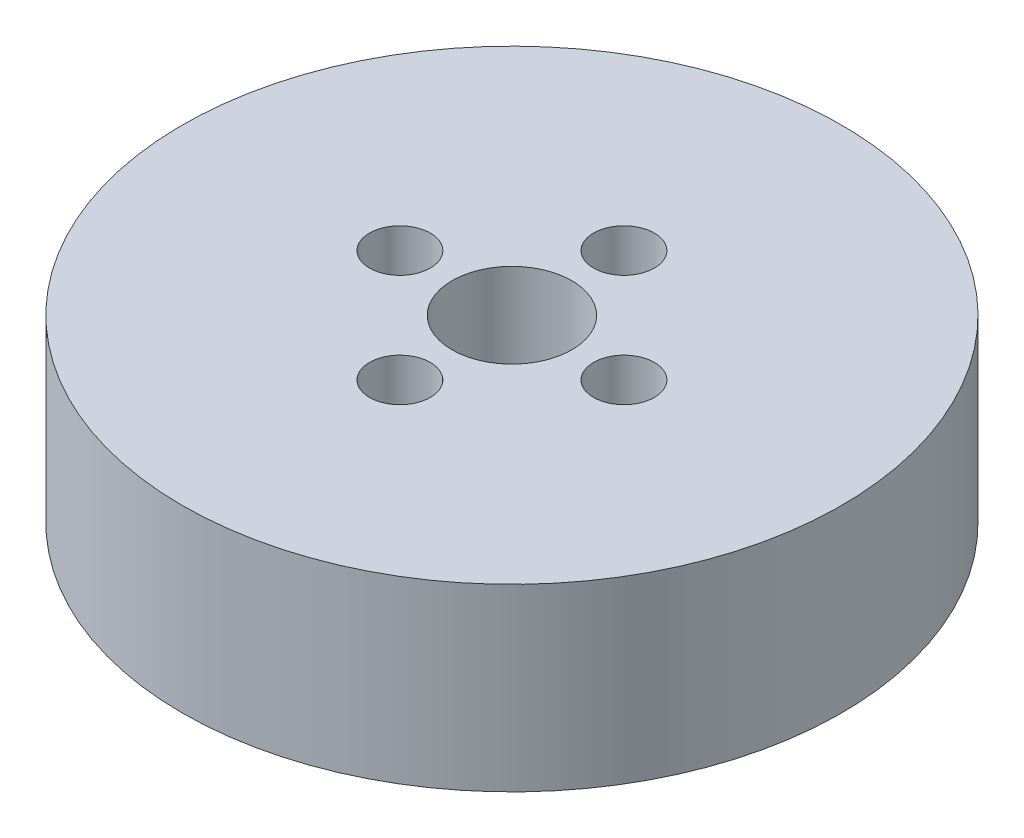
ISO-10303-21;
HEADER;
FILE_DESCRIPTION(('STEP AP214'),'2;1');
FILE_NAME('part.step','',(''),(''),'','','');
FILE_SCHEMA(('AUTOMOTIVE_DESIGN { 1 0 10303 214 1 1 1 1 }'));
ENDSEC;
DATA;
#1=APPLICATION_CONTEXT('core data for automotive mechanical design processes');
#2=APPLICATION_PROTOCOL_DEFINITION('international standard','automotive_design',2000,#1);
#3=PRODUCT_CONTEXT('',#1,'mechanical');
#4=PRODUCT('Part','Part','',(#3));
#5=PRODUCT_RELATED_PRODUCT_CATEGORY('part','',(#4));
#6=PRODUCT_DEFINITION_FORMATION('','',#4);
#7=PRODUCT_DEFINITION_CONTEXT('part definition',#1,'design');
#8=PRODUCT_DEFINITION('design','',#6,#7);
#9=PRODUCT_DEFINITION_SHAPE('','',#8);
#10=(LENGTH_UNIT() NAMED_UNIT(*) SI_UNIT(.MILLI.,.METRE.));
#11=(NAMED_UNIT(*) PLANE_ANGLE_UNIT() SI_UNIT($,.RADIAN.));
#12=(NAMED_UNIT(*) SI_UNIT($,.STERADIAN.) SOLID_ANGLE_UNIT());
#13=UNCERTAINTY_MEASURE_WITH_UNIT(LENGTH_MEASURE(1.E-05),#10,'distance_accuracy_value','');
#14=(GEOMETRIC_REPRESENTATION_CONTEXT(3) GLOBAL_UNCERTAINTY_ASSIGNED_CONTEXT((#13)) GLOBAL_UNIT_ASSIGNED_CONTEXT((#10,
#11,#12)) REPRESENTATION_CONTEXT('',''));
#15=CARTESIAN_POINT('',(0.,0.,0.));
#16=DIRECTION('',(0.,0.,1.));
#17=DIRECTION('',(1.,0.,0.));
#18=AXIS2_PLACEMENT_3D('',#15,#16,#17);
#19=CARTESIAN_POINT('',(0.,15.,0.));
#20=DIRECTION('',(0.,-1.,0.));
#21=DIRECTION('',(0.,0.,-1.));
#22=AXIS2_PLACEMENT_3D('',#19,#20,#21);
#23=CYLINDRICAL_SURFACE('',#22,27.5);
#24=CARTESIAN_POINT('',(0.,15.,0.));
#25=DIRECTION('',(0.,1.,0.));
#26=DIRECTION('',(0.,0.,1.));
#27=AXIS2_PLACEMENT_3D('',#24,#25,#26);
#28=CIRCLE('',#27,27.5);
#29=CARTESIAN_POINT('',(0.,15.,27.5));
#30=VERTEX_POINT('',#29);
#31=EDGE_CURVE('E10',#30,#30,#28,.T.);
#32=ORIENTED_EDGE('',*,*,#31,.F.);
#33=EDGE_LOOP('',(#32));
#34=FACE_BOUND('',#33,.T.);
#35=CARTESIAN_POINT('',(0.,0.,0.));
#36=DIRECTION('',(0.,1.,0.));
#37=DIRECTION('',(0.,0.,1.));
#38=AXIS2_PLACEMENT_3D('',#35,#36,#37);
#39=CIRCLE('',#38,27.5);
#40=CARTESIAN_POINT('',(0.,0.,27.5));
#41=VERTEX_POINT('',#40);
#42=EDGE_CURVE('E37',#41,#41,#39,.T.);
#43=ORIENTED_EDGE('',*,*,#42,.T.);
#44=EDGE_LOOP('',(#43));
#45=FACE_BOUND('',#44,.T.);
#46=ADVANCED_FACE('F40',(#34,#45),#23,.T.);
#47=CARTESIAN_POINT('',(0.,15.,0.));
#48=DIRECTION('',(0.,1.,0.));
#49=DIRECTION('',(0.,0.,1.));
#50=AXIS2_PLACEMENT_3D('',#47,#48,#49);
#51=PLANE('',#50);
#52=CARTESIAN_POINT('',(0.,15.,9.34783461895643));
#53=DIRECTION('',(0.,1.,0.));
#54=DIRECTION('',(1.,0.,0.));
#55=AXIS2_PLACEMENT_3D('',#52,#53,#54);
#56=CIRCLE('',#55,2.53467214283654);
#57=CARTESIAN_POINT('',(2.53467214283657,15.,9.34783461895642));
#58=VERTEX_POINT('',#57);
#59=EDGE_CURVE('E71',#58,#58,#56,.T.);
#60=ORIENTED_EDGE('',*,*,#59,.F.);
#61=EDGE_LOOP('',(#60));
#62=FACE_BOUND('',#61,.T.);
#63=CARTESIAN_POINT('',(9.34783461895643,15.,0.));
#64=DIRECTION('',(0.,1.,0.));
#65=DIRECTION('',(0.,0.,-1.));
#66=AXIS2_PLACEMENT_3D('',#63,#64,#65);
#67=CIRCLE('',#66,2.53467214283654);
#68=CARTESIAN_POINT('',(9.34783461895643,15.,-2.53467214283654));
#69=VERTEX_POINT('',#68);
#70=EDGE_CURVE('E70',#69,#69,#67,.T.);
#71=ORIENTED_EDGE('',*,*,#70,.F.);
#72=EDGE_LOOP('',(#71));
#73=FACE_BOUND('',#72,.T.);
#74=CARTESIAN_POINT('',(0.,15.,-9.34783461895643));
#75=DIRECTION('',(0.,1.,0.));
#76=DIRECTION('',(-1.,0.,0.));
#77=AXIS2_PLACEMENT_3D('',#74,#75,#76);
#78=CIRCLE('',#77,2.53467214283654);
#79=CARTESIAN_POINT('',(-2.53467214283664,15.,-9.3478346189564));
#80=VERTEX_POINT('',#79);
#81=EDGE_CURVE('E61',#80,#80,#78,.T.);
#82=ORIENTED_EDGE('',*,*,#81,.F.);
#83=EDGE_LOOP('',(#82));
#84=FACE_BOUND('',#83,.T.);
#85=CARTESIAN_POINT('',(-9.34783461895643,15.,0.));
#86=DIRECTION('',(0.,1.,0.));
#87=DIRECTION('',(0.,0.,1.));
#88=AXIS2_PLACEMENT_3D('',#85,#86,#87);
#89=CIRCLE('',#88,2.53467214283654);
#90=CARTESIAN_POINT('',(-9.34783461895643,15.,2.53467214283654));
#91=VERTEX_POINT('',#90);
#92=EDGE_CURVE('E54',#91,#91,#89,.T.);
#93=ORIENTED_EDGE('',*,*,#92,.F.);
#94=EDGE_LOOP('',(#93));
#95=FACE_BOUND('',#94,.T.);
#96=CARTESIAN_POINT('',(0.,15.,0.));
#97=DIRECTION('',(0.,1.,0.));
#98=DIRECTION('',(0.,0.,1.));
#99=AXIS2_PLACEMENT_3D('',#96,#97,#98);
#100=CIRCLE('',#99,5.);
#101=CARTESIAN_POINT('',(0.,15.,5.));
#102=VERTEX_POINT('',#101);
#103=EDGE_CURVE('E50',#102,#102,#100,.T.);
#104=ORIENTED_EDGE('',*,*,#103,.F.);
#105=EDGE_LOOP('',(#104));
#106=FACE_BOUND('',#105,.T.);
#107=ORIENTED_EDGE('',*,*,#31,.T.);
#108=EDGE_LOOP('',(#107));
#109=FACE_BOUND('',#108,.T.);
#110=ADVANCED_FACE('F86',(#62,#73,#84,#95,#106,#109),#51,.T.);
#111=CARTESIAN_POINT('',(0.,0.,0.));
#112=DIRECTION('',(0.,1.,0.));
#113=DIRECTION('',(0.,0.,1.));
#114=AXIS2_PLACEMENT_3D('',#111,#112,#113);
#115=PLANE('',#114);
#116=CARTESIAN_POINT('',(0.,0.,0.));
#117=DIRECTION('',(0.,1.,0.));
#118=DIRECTION('',(0.,0.,1.));
#119=AXIS2_PLACEMENT_3D('',#116,#117,#118);
#120=CIRCLE('',#119,5.);
#121=CARTESIAN_POINT('',(0.,0.,5.));
#122=VERTEX_POINT('',#121);
#123=EDGE_CURVE('E47',#122,#122,#120,.T.);
#124=ORIENTED_EDGE('',*,*,#123,.T.);
#125=EDGE_LOOP('',(#124));
#126=FACE_BOUND('',#125,.T.);
#127=ORIENTED_EDGE('',*,*,#42,.F.);
#128=EDGE_LOOP('',(#127));
#129=FACE_BOUND('',#128,.T.);
#130=ADVANCED_FACE('F93',(#126,#129),#115,.F.);
#131=CARTESIAN_POINT('',(0.,15.,0.));
#132=DIRECTION('',(0.,-1.,0.));
#133=DIRECTION('',(0.,0.,-1.));
#134=AXIS2_PLACEMENT_3D('',#131,#132,#133);
#135=CYLINDRICAL_SURFACE('',#134,5.);
#136=ORIENTED_EDGE('',*,*,#103,.T.);
#137=EDGE_LOOP('',(#136));
#138=FACE_BOUND('',#137,.T.);
#139=ORIENTED_EDGE('',*,*,#123,.F.);
#140=EDGE_LOOP('',(#139));
#141=FACE_BOUND('',#140,.T.);
#142=ADVANCED_FACE('F101',(#138,#141),#135,.F.);
#143=CARTESIAN_POINT('',(-9.34783461895643,3.31610109271724,0.));
#144=DIRECTION('',(0.,1.,0.));
#145=DIRECTION('',(0.,0.,1.));
#146=AXIS2_PLACEMENT_3D('',#143,#144,#145);
#147=CYLINDRICAL_SURFACE('',#146,2.53467214283654);
#148=CARTESIAN_POINT('',(-9.34783461895643,3.31610109271724,0.));
#149=DIRECTION('',(0.,1.,0.));
#150=DIRECTION('',(0.,0.,1.));
#151=AXIS2_PLACEMENT_3D('',#148,#149,#150);
#152=CIRCLE('',#151,2.53467214283654);
#153=CARTESIAN_POINT('',(-9.34783461895643,3.31610109271724,2.53467214283654));
#154=VERTEX_POINT('',#153);
#155=EDGE_CURVE('E55',#154,#154,#152,.T.);
#156=ORIENTED_EDGE('',*,*,#155,.F.);
#157=EDGE_LOOP('',(#156));
#158=FACE_BOUND('',#157,.T.);
#159=ORIENTED_EDGE('',*,*,#92,.T.);
#160=EDGE_LOOP('',(#159));
#161=FACE_BOUND('',#160,.T.);
#162=ADVANCED_FACE('F102',(#158,#161),#147,.F.);
#163=CARTESIAN_POINT('',(-9.34783461895643,3.31610109271724,0.));
#164=DIRECTION('',(0.,1.,0.));
#165=DIRECTION('',(0.,0.,1.));
#166=AXIS2_PLACEMENT_3D('',#163,#164,#165);
#167=PLANE('',#166);
#168=ORIENTED_EDGE('',*,*,#155,.T.);
#169=EDGE_LOOP('',(#168));
#170=FACE_BOUND('',#169,.T.);
#171=ADVANCED_FACE('F133',(#170),#167,.T.);
#172=CARTESIAN_POINT('',(0.,3.31610109271724,-9.34783461895643));
#173=DIRECTION('',(0.,1.,0.));
#174=DIRECTION('',(0.,0.,1.));
#175=AXIS2_PLACEMENT_3D('',#172,#173,#174);
#176=CYLINDRICAL_SURFACE('',#175,2.53467214283654);
#177=CARTESIAN_POINT('',(0.,3.31610109271724,-9.34783461895643));
#178=DIRECTION('',(0.,1.,0.));
#179=DIRECTION('',(-1.,0.,0.));
#180=AXIS2_PLACEMENT_3D('',#177,#178,#179);
#181=CIRCLE('',#180,2.53467214283654);
#182=CARTESIAN_POINT('',(-2.53467214283664,3.31610109271724,-9.3478346189564));
#183=VERTEX_POINT('',#182);
#184=EDGE_CURVE('E63',#183,#183,#181,.T.);
#185=ORIENTED_EDGE('',*,*,#184,.F.);
#186=EDGE_LOOP('',(#185));
#187=FACE_BOUND('',#186,.T.);
#188=ORIENTED_EDGE('',*,*,#81,.T.);
#189=EDGE_LOOP('',(#188));
#190=FACE_BOUND('',#189,.T.);
#191=ADVANCED_FACE('F142',(#187,#190),#176,.F.);
#192=CARTESIAN_POINT('',(0.,3.31610109271724,-9.34783461895643));
#193=DIRECTION('',(0.,1.,0.));
#194=DIRECTION('',(-1.,0.,0.));
#195=AXIS2_PLACEMENT_3D('',#192,#193,#194);
#196=PLANE('',#195);
#197=ORIENTED_EDGE('',*,*,#184,.T.);
#198=EDGE_LOOP('',(#197));
#199=FACE_BOUND('',#198,.T.);
#200=ADVANCED_FACE('F156',(#199),#196,.T.);
#201=CARTESIAN_POINT('',(9.34783461895643,3.31610109271724,0.));
#202=DIRECTION('',(0.,1.,0.));
#203=DIRECTION('',(0.,0.,1.));
#204=AXIS2_PLACEMENT_3D('',#201,#202,#203);
#205=CYLINDRICAL_SURFACE('',#204,2.53467214283654);
#206=CARTESIAN_POINT('',(9.34783461895643,3.31610109271724,0.));
#207=DIRECTION('',(0.,1.,0.));
#208=DIRECTION('',(0.,0.,-1.));
#209=AXIS2_PLACEMENT_3D('',#206,#207,#208);
#210=CIRCLE('',#209,2.53467214283654);
#211=CARTESIAN_POINT('',(9.34783461895643,3.31610109271724,-2.53467214283654));
#212=VERTEX_POINT('',#211);
#213=EDGE_CURVE('E69',#212,#212,#210,.T.);
#214=ORIENTED_EDGE('',*,*,#213,.F.);
#215=EDGE_LOOP('',(#214));
#216=FACE_BOUND('',#215,.T.);
#217=ORIENTED_EDGE('',*,*,#70,.T.);
#218=EDGE_LOOP('',(#217));
#219=FACE_BOUND('',#218,.T.);
#220=ADVANCED_FACE('F164',(#216,#219),#205,.F.);
#221=CARTESIAN_POINT('',(9.34783461895643,3.31610109271724,0.));
#222=DIRECTION('',(0.,1.,0.));
#223=DIRECTION('',(0.,0.,-1.));
#224=AXIS2_PLACEMENT_3D('',#221,#222,#223);
#225=PLANE('',#224);
#226=ORIENTED_EDGE('',*,*,#213,.T.);
#227=EDGE_LOOP('',(#226));
#228=FACE_BOUND('',#227,.T.);
#229=ADVANCED_FACE('F83',(#228),#225,.T.);
#230=CARTESIAN_POINT('',(0.,3.31610109271724,9.34783461895643));
#231=DIRECTION('',(0.,1.,0.));
#232=DIRECTION('',(0.,0.,1.));
#233=AXIS2_PLACEMENT_3D('',#230,#231,#232);
#234=CYLINDRICAL_SURFACE('',#233,2.53467214283654);
#235=CARTESIAN_POINT('',(0.,3.31610109271724,9.34783461895643));
#236=DIRECTION('',(0.,1.,0.));
#237=DIRECTION('',(1.,0.,0.));
#238=AXIS2_PLACEMENT_3D('',#235,#236,#237);
#239=CIRCLE('',#238,2.53467214283654);
#240=CARTESIAN_POINT('',(2.53467214283657,3.31610109271724,9.34783461895642));
#241=VERTEX_POINT('',#240);
#242=EDGE_CURVE('E59',#241,#241,#239,.T.);
#243=ORIENTED_EDGE('',*,*,#242,.F.);
#244=EDGE_LOOP('',(#243));
#245=FACE_BOUND('',#244,.T.);
#246=ORIENTED_EDGE('',*,*,#59,.T.);
#247=EDGE_LOOP('',(#246));
#248=FACE_BOUND('',#247,.T.);
#249=ADVANCED_FACE('F81',(#245,#248),#234,.F.);
#250=CARTESIAN_POINT('',(0.,3.31610109271724,9.34783461895643));
#251=DIRECTION('',(0.,1.,0.));
#252=DIRECTION('',(1.,0.,0.));
#253=AXIS2_PLACEMENT_3D('',#250,#251,#252);
#254=PLANE('',#253);
#255=ORIENTED_EDGE('',*,*,#242,.T.);
#256=EDGE_LOOP('',(#255));
#257=FACE_BOUND('',#256,.T.);
#258=ADVANCED_FACE('F78',(#257),#254,.T.);
#259=CLOSED_SHELL('',(#46,#110,#130,#142,#162,#171,#191,#200,#220,#229,#249,#258));
#260=MANIFOLD_SOLID_BREP('B2',#259);
#261=ADVANCED_BREP_SHAPE_REPRESENTATION('',(#18,#260),#14);
#262=SHAPE_DEFINITION_REPRESENTATION(#9,#261);
ENDSEC;
END-ISO-10303-21;
